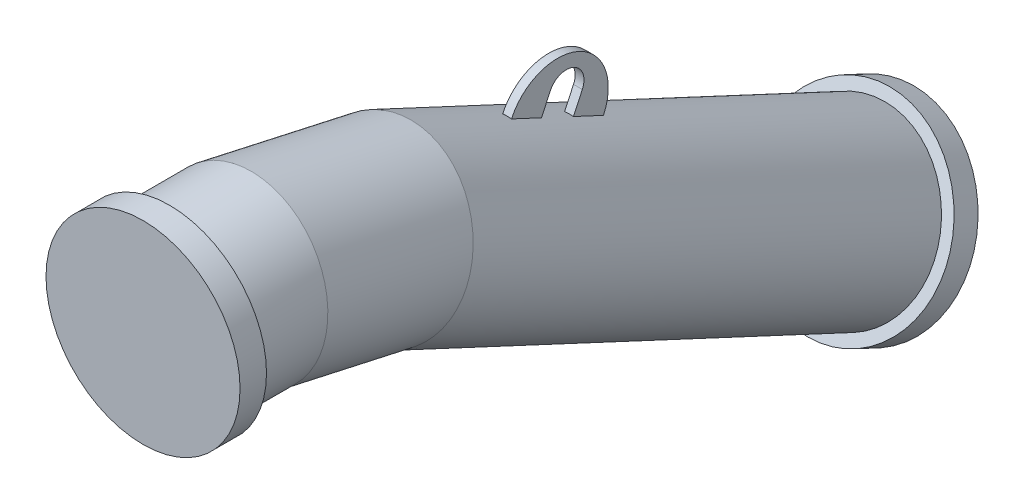
ISO-10303-21;
HEADER;
FILE_DESCRIPTION(('STEP AP214'),'2;1');
FILE_NAME('part.step','',(''),(''),'','','');
FILE_SCHEMA(('AUTOMOTIVE_DESIGN { 1 0 10303 214 1 1 1 1 }'));
ENDSEC;
DATA;
#1=APPLICATION_CONTEXT('core data for automotive mechanical design processes');
#2=APPLICATION_PROTOCOL_DEFINITION('international standard','automotive_design',2000,#1);
#3=PRODUCT_CONTEXT('',#1,'mechanical');
#4=PRODUCT('Part','Part','',(#3));
#5=PRODUCT_RELATED_PRODUCT_CATEGORY('part','',(#4));
#6=PRODUCT_DEFINITION_FORMATION('','',#4);
#7=PRODUCT_DEFINITION_CONTEXT('part definition',#1,'design');
#8=PRODUCT_DEFINITION('design','',#6,#7);
#9=PRODUCT_DEFINITION_SHAPE('','',#8);
#10=(LENGTH_UNIT() NAMED_UNIT(*) SI_UNIT(.MILLI.,.METRE.));
#11=(NAMED_UNIT(*) PLANE_ANGLE_UNIT() SI_UNIT($,.RADIAN.));
#12=(NAMED_UNIT(*) SI_UNIT($,.STERADIAN.) SOLID_ANGLE_UNIT());
#13=UNCERTAINTY_MEASURE_WITH_UNIT(LENGTH_MEASURE(1.E-05),#10,'distance_accuracy_value','');
#14=(GEOMETRIC_REPRESENTATION_CONTEXT(3) GLOBAL_UNCERTAINTY_ASSIGNED_CONTEXT((#13)) GLOBAL_UNIT_ASSIGNED_CONTEXT((#10,
#11,#12)) REPRESENTATION_CONTEXT('',''));
#15=CARTESIAN_POINT('',(0.,0.,0.));
#16=DIRECTION('',(0.,0.,1.));
#17=DIRECTION('',(1.,0.,0.));
#18=AXIS2_PLACEMENT_3D('',#15,#16,#17);
#19=CARTESIAN_POINT('',(-1.33192864732209E-12,-246.865120190447,-725.67495566305));
#20=DIRECTION('',(0.,-0.422618261740698,-0.90630778703665));
#21=DIRECTION('',(-1.,0.,0.));
#22=AXIS2_PLACEMENT_3D('',#19,#20,#21);
#23=CYLINDRICAL_SURFACE('',#22,96.85);
#24=CARTESIAN_POINT('',(-1.55094931639422E-12,-97.7393467356555,-405.873702462908));
#25=DIRECTION('',(0.,0.422618261740698,0.906307787036652));
#26=DIRECTION('',(0.,-0.906307787036651,0.422618261740697));
#27=AXIS2_PLACEMENT_3D('',#24,#25,#26);
#28=CIRCLE('',#27,96.85);
#29=CARTESIAN_POINT('',(4.99999999999824,-10.0804887332322,-446.74969925456));
#30=VERTEX_POINT('',#29);
#31=CARTESIAN_POINT('',(-5.00000000000187,-10.0804887332323,-446.74969925456));
#32=VERTEX_POINT('',#31);
#33=EDGE_CURVE('E187',#30,#32,#28,.T.);
#34=ORIENTED_EDGE('',*,*,#33,.F.);
#35=DIRECTION('',(0.,-0.422618261740698,-0.90630778703665));
#36=VECTOR('',#35,1.);
#37=CARTESIAN_POINT('',(4.99999999999847,-159.206262188024,-766.550952454702));
#38=LINE('',#37,#36);
#39=CARTESIAN_POINT('',(4.9999999999982,5.76769608204332,-412.763157240686));
#40=VERTEX_POINT('',#39);
#41=EDGE_CURVE('E183',#30,#40,#38,.F.);
#42=ORIENTED_EDGE('',*,*,#41,.T.);
#43=CARTESIAN_POINT('',(-1.57422550776884E-12,-81.8911619203795,-371.887160449034));
#44=DIRECTION('',(0.,-0.4226182617407,-0.90630778703665));
#45=DIRECTION('',(0.,0.90630778703665,-0.4226182617407));
#46=AXIS2_PLACEMENT_3D('',#43,#44,#45);
#47=CIRCLE('',#46,96.85);
#48=CARTESIAN_POINT('',(-5.00000000000185,5.76769608204315,-412.763157240686));
#49=VERTEX_POINT('',#48);
#50=EDGE_CURVE('E176',#49,#40,#47,.T.);
#51=ORIENTED_EDGE('',*,*,#50,.F.);
#52=DIRECTION('',(0.,-0.422618261740698,-0.90630778703665));
#53=VECTOR('',#52,1.);
#54=CARTESIAN_POINT('',(-5.0000000000017,-159.206262188024,-766.550952454702));
#55=LINE('',#54,#53);
#56=EDGE_CURVE('E180',#32,#49,#55,.F.);
#57=ORIENTED_EDGE('',*,*,#56,.F.);
#58=EDGE_LOOP('',(#34,#42,#51,#57));
#59=FACE_BOUND('',#58,.T.);
#60=CARTESIAN_POINT('',(-1.28094549644873E-12,-281.57829059286,-800.117589823852));
#61=DIRECTION('',(0.,0.422618261740698,0.90630778703665));
#62=DIRECTION('',(1.,0.,0.));
#63=AXIS2_PLACEMENT_3D('',#60,#61,#62);
#64=CIRCLE('',#63,96.85);
#65=CARTESIAN_POINT('',(96.8499999999987,-281.578290592859,-800.117589823852));
#66=VERTEX_POINT('',#65);
#67=EDGE_CURVE('E157',#66,#66,#64,.T.);
#68=ORIENTED_EDGE('',*,*,#67,.T.);
#69=EDGE_LOOP('',(#68));
#70=FACE_BOUND('',#69,.T.);
#71=CARTESIAN_POINT('',(0.,-35.5559893201033,-272.521062144722));
#72=DIRECTION('',(0.,-0.321439465303161,-0.946930129495106));
#73=DIRECTION('',(0.,0.946930129495106,-0.321439465303161));
#74=AXIS2_PLACEMENT_3D('',#71,#72,#73);
#75=ELLIPSE('',#74,97.4290855317092,96.85);
#76=CARTESIAN_POINT('',(-1.95303570963235E-13,56.7025472590278,-303.83861530301));
#77=VERTEX_POINT('',#76);
#78=EDGE_CURVE('E165',#77,#77,#75,.T.);
#79=ORIENTED_EDGE('',*,*,#78,.T.);
#80=EDGE_LOOP('',(#79));
#81=FACE_BOUND('',#80,.T.);
#82=CARTESIAN_POINT('',(-1.52612137892797E-12,-114.644077205284,-442.126013944375));
#83=DIRECTION('',(0.,-0.422618261740698,-0.906307787036654));
#84=DIRECTION('',(0.,0.906307787036651,-0.422618261740697));
#85=AXIS2_PLACEMENT_3D('',#82,#83,#84);
#86=CIRCLE('',#85,96.85);
#87=CARTESIAN_POINT('',(-5.00000000000185,-26.9852192028604,-483.002010736027));
#88=VERTEX_POINT('',#87);
#89=CARTESIAN_POINT('',(4.99999999999826,-26.9852192028604,-483.002010736027));
#90=VERTEX_POINT('',#89);
#91=EDGE_CURVE('E10',#88,#90,#86,.T.);
#92=ORIENTED_EDGE('',*,*,#91,.F.);
#93=CARTESIAN_POINT('',(-5.00000000000178,-42.8334040181372,-516.988552749901));
#94=VERTEX_POINT('',#93);
#95=EDGE_CURVE('E184',#94,#88,#55,.F.);
#96=ORIENTED_EDGE('',*,*,#95,.F.);
#97=CARTESIAN_POINT('',(-1.50284518755336E-12,-130.49226202056,-476.11255595825));
#98=DIRECTION('',(0.,0.4226182617407,0.90630778703665));
#99=DIRECTION('',(0.,-0.90630778703665,0.4226182617407));
#100=AXIS2_PLACEMENT_3D('',#97,#98,#99);
#101=CIRCLE('',#100,96.85);
#102=CARTESIAN_POINT('',(4.99999999999827,-42.8334040181371,-516.988552749901));
#103=VERTEX_POINT('',#102);
#104=EDGE_CURVE('E104',#103,#94,#101,.T.);
#105=ORIENTED_EDGE('',*,*,#104,.F.);
#106=EDGE_CURVE('E25',#103,#90,#38,.F.);
#107=ORIENTED_EDGE('',*,*,#106,.T.);
#108=EDGE_LOOP('',(#92,#96,#105,#107));
#109=FACE_BOUND('',#108,.T.);
#110=ADVANCED_FACE('F16',(#59,#70,#81,#109),#23,.T.);
#111=CARTESIAN_POINT('',(0.,0.,-30.));
#112=DIRECTION('',(0.,0.,1.));
#113=DIRECTION('',(1.,0.,0.));
#114=AXIS2_PLACEMENT_3D('',#111,#112,#113);
#115=CYLINDRICAL_SURFACE('',#114,110.);
#116=CARTESIAN_POINT('',(0.,0.,-30.));
#117=DIRECTION('',(0.,0.,1.));
#118=DIRECTION('',(1.,0.,0.));
#119=AXIS2_PLACEMENT_3D('',#116,#117,#118);
#120=CIRCLE('',#119,110.);
#121=CARTESIAN_POINT('',(110.,0.,-30.));
#122=VERTEX_POINT('',#121);
#123=EDGE_CURVE('E153',#122,#122,#120,.T.);
#124=ORIENTED_EDGE('',*,*,#123,.T.);
#125=EDGE_LOOP('',(#124));
#126=FACE_BOUND('',#125,.T.);
#127=CARTESIAN_POINT('',(0.,0.,0.));
#128=DIRECTION('',(0.,0.,1.));
#129=DIRECTION('',(1.,0.,0.));
#130=AXIS2_PLACEMENT_3D('',#127,#128,#129);
#131=CIRCLE('',#130,110.);
#132=CARTESIAN_POINT('',(110.,0.,0.));
#133=VERTEX_POINT('',#132);
#134=EDGE_CURVE('E149',#133,#133,#131,.T.);
#135=ORIENTED_EDGE('',*,*,#134,.F.);
#136=EDGE_LOOP('',(#135));
#137=FACE_BOUND('',#136,.T.);
#138=ADVANCED_FACE('F330',(#126,#137),#115,.T.);
#139=CARTESIAN_POINT('',(0.,0.,-30.));
#140=DIRECTION('',(0.,0.,1.));
#141=DIRECTION('',(1.,0.,0.));
#142=AXIS2_PLACEMENT_3D('',#139,#140,#141);
#143=PLANE('',#142);
#144=CARTESIAN_POINT('',(0.,0.,-30.));
#145=DIRECTION('',(0.,0.,-1.));
#146=DIRECTION('',(-1.,0.,0.));
#147=AXIS2_PLACEMENT_3D('',#144,#145,#146);
#148=CIRCLE('',#147,96.85);
#149=CARTESIAN_POINT('',(-96.85,0.,-30.));
#150=VERTEX_POINT('',#149);
#151=EDGE_CURVE('E164',#150,#150,#148,.T.);
#152=ORIENTED_EDGE('',*,*,#151,.F.);
#153=EDGE_LOOP('',(#152));
#154=FACE_BOUND('',#153,.T.);
#155=ORIENTED_EDGE('',*,*,#123,.F.);
#156=EDGE_LOOP('',(#155));
#157=FACE_BOUND('',#156,.T.);
#158=ADVANCED_FACE('F352',(#154,#157),#143,.F.);
#159=CARTESIAN_POINT('',(-8.66756315891309E-13,-281.578290592858,-800.117589823852));
#160=DIRECTION('',(0.,-0.422618261740699,-0.906307787036654));
#161=DIRECTION('',(1.,0.,0.));
#162=AXIS2_PLACEMENT_3D('',#159,#160,#161);
#163=CYLINDRICAL_SURFACE('',#162,110.);
#164=CARTESIAN_POINT('',(-8.66756315891309E-13,-281.578290592858,-800.117589823852));
#165=DIRECTION('',(0.,-0.422618261740699,-0.906307787036654));
#166=DIRECTION('',(1.,0.,0.));
#167=AXIS2_PLACEMENT_3D('',#164,#165,#166);
#168=CIRCLE('',#167,110.);
#169=CARTESIAN_POINT('',(109.999999999999,-281.578290592858,-800.117589823852));
#170=VERTEX_POINT('',#169);
#171=EDGE_CURVE('E145',#170,#170,#168,.T.);
#172=ORIENTED_EDGE('',*,*,#171,.T.);
#173=EDGE_LOOP('',(#172));
#174=FACE_BOUND('',#173,.T.);
#175=CARTESIAN_POINT('',(-8.46976895735712E-13,-294.256838445079,-827.306823434952));
#176=DIRECTION('',(0.,-0.422618261740699,-0.906307787036654));
#177=DIRECTION('',(1.,0.,0.));
#178=AXIS2_PLACEMENT_3D('',#175,#176,#177);
#179=CIRCLE('',#178,110.);
#180=CARTESIAN_POINT('',(109.999999999999,-294.256838445079,-827.306823434952));
#181=VERTEX_POINT('',#180);
#182=EDGE_CURVE('E144',#181,#181,#179,.T.);
#183=ORIENTED_EDGE('',*,*,#182,.F.);
#184=EDGE_LOOP('',(#183));
#185=FACE_BOUND('',#184,.T.);
#186=ADVANCED_FACE('F361',(#174,#185),#163,.T.);
#187=CARTESIAN_POINT('',(-8.66756315891309E-13,-281.578290592858,-800.117589823852));
#188=DIRECTION('',(0.,-0.422618261740699,-0.906307787036654));
#189=DIRECTION('',(1.,0.,0.));
#190=AXIS2_PLACEMENT_3D('',#187,#188,#189);
#191=PLANE('',#190);
#192=ORIENTED_EDGE('',*,*,#67,.F.);
#193=EDGE_LOOP('',(#192));
#194=FACE_BOUND('',#193,.T.);
#195=ORIENTED_EDGE('',*,*,#171,.F.);
#196=EDGE_LOOP('',(#195));
#197=FACE_BOUND('',#196,.T.);
#198=ADVANCED_FACE('F347',(#194,#197),#191,.F.);
#199=CARTESIAN_POINT('',(0.,0.,-112.138358762432));
#200=DIRECTION('',(0.,0.,1.));
#201=DIRECTION('',(1.,0.,0.));
#202=AXIS2_PLACEMENT_3D('',#199,#200,#201);
#203=CYLINDRICAL_SURFACE('',#202,96.85);
#204=ORIENTED_EDGE('',*,*,#151,.T.);
#205=EDGE_LOOP('',(#204));
#206=FACE_BOUND('',#205,.T.);
#207=CARTESIAN_POINT('',(0.,0.,-112.138358762432));
#208=DIRECTION('',(0.,-0.108866874851965,-0.99405633822232));
#209=DIRECTION('',(0.,-0.99405633822232,0.108866874851965));
#210=AXIS2_PLACEMENT_3D('',#207,#208,#209);
#211=ELLIPSE('',#210,97.4290855317092,96.85);
#212=CARTESIAN_POINT('',(0.,-96.85,-101.53155870091));
#213=VERTEX_POINT('',#212);
#214=EDGE_CURVE('E169',#213,#213,#211,.T.);
#215=ORIENTED_EDGE('',*,*,#214,.F.);
#216=EDGE_LOOP('',(#215));
#217=FACE_BOUND('',#216,.T.);
#218=ADVANCED_FACE('F18',(#206,#217),#203,.T.);
#219=CARTESIAN_POINT('',(0.,-4.35762537165374E-12,-112.138358762433));
#220=DIRECTION('',(0.,-0.216439613938102,-0.976296007119934));
#221=DIRECTION('',(0.,-0.976296007119934,0.216439613938102));
#222=AXIS2_PLACEMENT_3D('',#219,#220,#221);
#223=CYLINDRICAL_SURFACE('',#222,96.85);
#224=ORIENTED_EDGE('',*,*,#214,.T.);
#225=EDGE_LOOP('',(#224));
#226=FACE_BOUND('',#225,.T.);
#227=ORIENTED_EDGE('',*,*,#78,.F.);
#228=EDGE_LOOP('',(#227));
#229=FACE_BOUND('',#228,.T.);
#230=ADVANCED_FACE('F336',(#226,#229),#223,.T.);
#231=CARTESIAN_POINT('',(4.99999999999815,3.018376367447,-474.925358743396));
#232=DIRECTION('',(1.00000000000001,0.,0.));
#233=DIRECTION('',(0.,0.906307787036647,-0.422618261740699));
#234=AXIS2_PLACEMENT_3D('',#231,#232,#233);
#235=PLANE('',#234);
#236=ORIENTED_EDGE('',*,*,#106,.F.);
#237=DIRECTION('',(0.,0.90630778703665,-0.4226182617407));
#238=VECTOR('',#237,1.);
#239=CARTESIAN_POINT('',(4.99999999999831,-51.6434845483714,-512.88034472969));
#240=LINE('',#239,#238);
#241=CARTESIAN_POINT('',(4.99999999999827,-42.5804066780046,-517.106527347097));
#242=VERTEX_POINT('',#241);
#243=EDGE_CURVE('E108',#103,#242,#240,.T.);
#244=ORIENTED_EDGE('',*,*,#243,.T.);
#245=CARTESIAN_POINT('',(4.99999999999824,-18.2798566279143,-464.99382959249));
#246=DIRECTION('',(1.00000000000001,0.,0.));
#247=DIRECTION('',(0.,0.906307787036647,-0.422618261740699));
#248=AXIS2_PLACEMENT_3D('',#245,#246,#247);
#249=CIRCLE('',#248,57.5);
#250=CARTESIAN_POINT('',(4.9999999999982,6.02069342217577,-412.881131837882));
#251=VERTEX_POINT('',#250);
#252=EDGE_CURVE('E126',#242,#251,#249,.T.);
#253=ORIENTED_EDGE('',*,*,#252,.T.);
#254=DIRECTION('',(0.,0.90630778703665,-0.4226182617407));
#255=VECTOR('',#254,1.);
#256=CARTESIAN_POINT('',(4.99999999999823,-3.04238444819065,-408.654949220475));
#257=LINE('',#256,#255);
#258=EDGE_CURVE('E245',#40,#251,#257,.T.);
#259=ORIENTED_EDGE('',*,*,#258,.F.);
#260=ORIENTED_EDGE('',*,*,#41,.F.);
#261=DIRECTION('',(0.,0.906307787036647,-0.4226182617407));
#262=VECTOR('',#261,1.);
#263=CARTESIAN_POINT('',(4.99999999999822,-9.82749139310026,-446.867673851756));
#264=LINE('',#263,#262);
#265=CARTESIAN_POINT('',(4.99999999999814,11.4707416022609,-456.799203002663));
#266=VERTEX_POINT('',#265);
#267=EDGE_CURVE('E120',#30,#266,#264,.T.);
#268=ORIENTED_EDGE('',*,*,#267,.T.);
#269=CARTESIAN_POINT('',(4.99999999999815,3.018376367447,-474.925358743396));
#270=DIRECTION('',(-1.00000000000001,0.,0.));
#271=DIRECTION('',(0.,0.906307787036647,-0.422618261740699));
#272=AXIS2_PLACEMENT_3D('',#269,#270,#271);
#273=CIRCLE('',#272,20.);
#274=CARTESIAN_POINT('',(4.99999999999815,-5.43398886736706,-493.051514484129));
#275=VERTEX_POINT('',#274);
#276=EDGE_CURVE('E223',#266,#275,#273,.T.);
#277=ORIENTED_EDGE('',*,*,#276,.T.);
#278=DIRECTION('',(0.,-0.906307787036647,0.422618261740699));
#279=VECTOR('',#278,1.);
#280=CARTESIAN_POINT('',(4.99999999999825,-26.7322218627283,-483.119985333223));
#281=LINE('',#280,#279);
#282=EDGE_CURVE('E218',#275,#90,#281,.T.);
#283=ORIENTED_EDGE('',*,*,#282,.T.);
#284=EDGE_LOOP('',(#236,#244,#253,#259,#260,#268,#277,#283));
#285=FACE_BOUND('',#284,.T.);
#286=ADVANCED_FACE('F313',(#285),#235,.T.);
#287=CARTESIAN_POINT('',(-5.00000000000189,3.01837636744686,-474.925358743396));
#288=DIRECTION('',(1.00000000000001,0.,0.));
#289=DIRECTION('',(0.,0.906307787036647,-0.422618261740699));
#290=AXIS2_PLACEMENT_3D('',#287,#288,#289);
#291=PLANE('',#290);
#292=DIRECTION('',(0.,0.90630778703665,-0.4226182617407));
#293=VECTOR('',#292,1.);
#294=CARTESIAN_POINT('',(-5.00000000000174,-51.6434845483714,-512.88034472969));
#295=LINE('',#294,#293);
#296=CARTESIAN_POINT('',(-5.00000000000178,-42.5804066780049,-517.106527347097));
#297=VERTEX_POINT('',#296);
#298=EDGE_CURVE('E98',#94,#297,#295,.T.);
#299=ORIENTED_EDGE('',*,*,#298,.F.);
#300=ORIENTED_EDGE('',*,*,#95,.T.);
#301=DIRECTION('',(0.,-0.906307787036647,0.422618261740699));
#302=VECTOR('',#301,1.);
#303=CARTESIAN_POINT('',(-5.0000000000018,-26.7322218627284,-483.119985333223));
#304=LINE('',#303,#302);
#305=CARTESIAN_POINT('',(-5.00000000000189,-5.43398886736714,-493.051514484129));
#306=VERTEX_POINT('',#305);
#307=EDGE_CURVE('E121',#306,#88,#304,.T.);
#308=ORIENTED_EDGE('',*,*,#307,.F.);
#309=CARTESIAN_POINT('',(-5.00000000000189,3.01837636744686,-474.925358743396));
#310=DIRECTION('',(-1.00000000000001,0.,0.));
#311=DIRECTION('',(0.,0.906307787036647,-0.422618261740699));
#312=AXIS2_PLACEMENT_3D('',#309,#310,#311);
#313=CIRCLE('',#312,20.);
#314=CARTESIAN_POINT('',(-5.00000000000191,11.4707416022609,-456.799203002663));
#315=VERTEX_POINT('',#314);
#316=EDGE_CURVE('E254',#315,#306,#313,.T.);
#317=ORIENTED_EDGE('',*,*,#316,.F.);
#318=DIRECTION('',(0.,0.906307787036647,-0.4226182617407));
#319=VECTOR('',#318,1.);
#320=CARTESIAN_POINT('',(-5.00000000000183,-9.82749139310038,-446.867673851756));
#321=LINE('',#320,#319);
#322=EDGE_CURVE('E107',#32,#315,#321,.T.);
#323=ORIENTED_EDGE('',*,*,#322,.F.);
#324=ORIENTED_EDGE('',*,*,#56,.T.);
#325=DIRECTION('',(0.,0.90630778703665,-0.4226182617407));
#326=VECTOR('',#325,1.);
#327=CARTESIAN_POINT('',(-5.00000000000182,-3.04238444819085,-408.654949220476));
#328=LINE('',#327,#326);
#329=CARTESIAN_POINT('',(-5.00000000000185,6.02069342217563,-412.881131837883));
#330=VERTEX_POINT('',#329);
#331=EDGE_CURVE('E115',#49,#330,#328,.T.);
#332=ORIENTED_EDGE('',*,*,#331,.T.);
#333=CARTESIAN_POINT('',(-5.00000000000181,-18.2798566279144,-464.99382959249));
#334=DIRECTION('',(1.00000000000001,0.,0.));
#335=DIRECTION('',(0.,0.906307787036647,-0.422618261740699));
#336=AXIS2_PLACEMENT_3D('',#333,#334,#335);
#337=CIRCLE('',#336,57.5);
#338=EDGE_CURVE('E111',#297,#330,#337,.T.);
#339=ORIENTED_EDGE('',*,*,#338,.F.);
#340=EDGE_LOOP('',(#299,#300,#308,#317,#323,#324,#332,#339));
#341=FACE_BOUND('',#340,.T.);
#342=ADVANCED_FACE('F112',(#341),#291,.F.);
#343=CARTESIAN_POINT('',(4.99999999999822,-9.82749139310026,-446.867673851756));
#344=DIRECTION('',(0.,0.422618261740698,0.906307787036652));
#345=DIRECTION('',(0.,-0.906307787036647,0.4226182617407));
#346=AXIS2_PLACEMENT_3D('',#343,#344,#345);
#347=PLANE('',#346);
#348=ORIENTED_EDGE('',*,*,#267,.F.);
#349=ORIENTED_EDGE('',*,*,#33,.T.);
#350=ORIENTED_EDGE('',*,*,#322,.T.);
#351=DIRECTION('',(-1.00000000000001,0.,0.));
#352=VECTOR('',#351,1.);
#353=CARTESIAN_POINT('',(4.99999999999814,11.4707416022609,-456.799203002663));
#354=LINE('',#353,#352);
#355=EDGE_CURVE('E136',#266,#315,#354,.T.);
#356=ORIENTED_EDGE('',*,*,#355,.F.);
#357=EDGE_LOOP('',(#348,#349,#350,#356));
#358=FACE_BOUND('',#357,.T.);
#359=ADVANCED_FACE('F326',(#358),#347,.F.);
#360=CARTESIAN_POINT('',(4.99999999999815,3.018376367447,-474.925358743396));
#361=DIRECTION('',(-1.00000000000001,0.,0.));
#362=DIRECTION('',(0.,-0.906307787036647,0.422618261740699));
#363=AXIS2_PLACEMENT_3D('',#360,#361,#362);
#364=CYLINDRICAL_SURFACE('',#363,20.);
#365=ORIENTED_EDGE('',*,*,#316,.T.);
#366=DIRECTION('',(-1.00000000000001,0.,0.));
#367=VECTOR('',#366,1.);
#368=CARTESIAN_POINT('',(4.99999999999815,-5.43398886736706,-493.051514484129));
#369=LINE('',#368,#367);
#370=EDGE_CURVE('E128',#275,#306,#369,.T.);
#371=ORIENTED_EDGE('',*,*,#370,.F.);
#372=ORIENTED_EDGE('',*,*,#276,.F.);
#373=ORIENTED_EDGE('',*,*,#355,.T.);
#374=EDGE_LOOP('',(#365,#371,#372,#373));
#375=FACE_BOUND('',#374,.T.);
#376=ADVANCED_FACE('F322',(#375),#364,.F.);
#377=CARTESIAN_POINT('',(4.99999999999825,-26.7322218627283,-483.119985333223));
#378=DIRECTION('',(0.,-0.422618261740698,-0.906307787036654));
#379=DIRECTION('',(0.,0.906307787036647,-0.422618261740699));
#380=AXIS2_PLACEMENT_3D('',#377,#378,#379);
#381=PLANE('',#380);
#382=ORIENTED_EDGE('',*,*,#307,.T.);
#383=ORIENTED_EDGE('',*,*,#91,.T.);
#384=ORIENTED_EDGE('',*,*,#282,.F.);
#385=ORIENTED_EDGE('',*,*,#370,.T.);
#386=EDGE_LOOP('',(#382,#383,#384,#385));
#387=FACE_BOUND('',#386,.T.);
#388=ADVANCED_FACE('F318',(#387),#381,.F.);
#389=CARTESIAN_POINT('',(4.99999999999824,-18.2798566279143,-464.99382959249));
#390=DIRECTION('',(-1.00000000000001,0.,0.));
#391=DIRECTION('',(0.,-0.906307787036647,0.422618261740699));
#392=AXIS2_PLACEMENT_3D('',#389,#390,#391);
#393=CYLINDRICAL_SURFACE('',#392,57.5);
#394=ORIENTED_EDGE('',*,*,#338,.T.);
#395=DIRECTION('',(-1.00000000000001,0.,0.));
#396=VECTOR('',#395,1.);
#397=CARTESIAN_POINT('',(4.9999999999982,6.02069342217577,-412.881131837882));
#398=LINE('',#397,#396);
#399=EDGE_CURVE('E129',#251,#330,#398,.T.);
#400=ORIENTED_EDGE('',*,*,#399,.F.);
#401=ORIENTED_EDGE('',*,*,#252,.F.);
#402=DIRECTION('',(-1.00000000000001,0.,0.));
#403=VECTOR('',#402,1.);
#404=CARTESIAN_POINT('',(4.99999999999827,-42.5804066780046,-517.106527347097));
#405=LINE('',#404,#403);
#406=EDGE_CURVE('E103',#242,#297,#405,.T.);
#407=ORIENTED_EDGE('',*,*,#406,.T.);
#408=EDGE_LOOP('',(#394,#400,#401,#407));
#409=FACE_BOUND('',#408,.T.);
#410=ADVANCED_FACE('F124',(#409),#393,.T.);
#411=CARTESIAN_POINT('',(-5.00000000000174,-51.6434845483714,-512.88034472969));
#412=DIRECTION('',(0.,0.4226182617407,0.90630778703665));
#413=DIRECTION('',(0.,-0.90630778703665,0.4226182617407));
#414=AXIS2_PLACEMENT_3D('',#411,#412,#413);
#415=PLANE('',#414);
#416=ORIENTED_EDGE('',*,*,#243,.F.);
#417=ORIENTED_EDGE('',*,*,#104,.T.);
#418=ORIENTED_EDGE('',*,*,#298,.T.);
#419=ORIENTED_EDGE('',*,*,#406,.F.);
#420=EDGE_LOOP('',(#416,#417,#418,#419));
#421=FACE_BOUND('',#420,.T.);
#422=ADVANCED_FACE('F101',(#421),#415,.F.);
#423=CARTESIAN_POINT('',(4.99999999999823,-3.04238444819065,-408.654949220475));
#424=DIRECTION('',(0.,-0.4226182617407,-0.90630778703665));
#425=DIRECTION('',(0.,0.90630778703665,-0.4226182617407));
#426=AXIS2_PLACEMENT_3D('',#423,#424,#425);
#427=PLANE('',#426);
#428=ORIENTED_EDGE('',*,*,#331,.F.);
#429=ORIENTED_EDGE('',*,*,#50,.T.);
#430=ORIENTED_EDGE('',*,*,#258,.T.);
#431=ORIENTED_EDGE('',*,*,#399,.T.);
#432=EDGE_LOOP('',(#428,#429,#430,#431));
#433=FACE_BOUND('',#432,.T.);
#434=ADVANCED_FACE('F310',(#433),#427,.F.);
#435=CARTESIAN_POINT('',(0.,0.,0.));
#436=DIRECTION('',(0.,0.,1.));
#437=DIRECTION('',(1.,0.,0.));
#438=AXIS2_PLACEMENT_3D('',#435,#436,#437);
#439=PLANE('',#438);
#440=ORIENTED_EDGE('',*,*,#134,.T.);
#441=EDGE_LOOP('',(#440));
#442=FACE_BOUND('',#441,.T.);
#443=ADVANCED_FACE('F354',(#442),#439,.T.);
#444=CARTESIAN_POINT('',(-8.46976895735712E-13,-294.256838445079,-827.306823434952));
#445=DIRECTION('',(0.,-0.422618261740699,-0.906307787036654));
#446=DIRECTION('',(1.,0.,0.));
#447=AXIS2_PLACEMENT_3D('',#444,#445,#446);
#448=PLANE('',#447);
#449=ORIENTED_EDGE('',*,*,#182,.T.);
#450=EDGE_LOOP('',(#449));
#451=FACE_BOUND('',#450,.T.);
#452=ADVANCED_FACE('F357',(#451),#448,.T.);
#453=CLOSED_SHELL('',(#110,#138,#158,#186,#198,#218,#230,#286,#342,#359,#376,#388,#410,#422,
#434,#443,#452));
#454=MANIFOLD_SOLID_BREP('B1',#453);
#455=ADVANCED_BREP_SHAPE_REPRESENTATION('',(#18,#454),#14);
#456=SHAPE_DEFINITION_REPRESENTATION(#9,#455);
ENDSEC;
END-ISO-10303-21;
